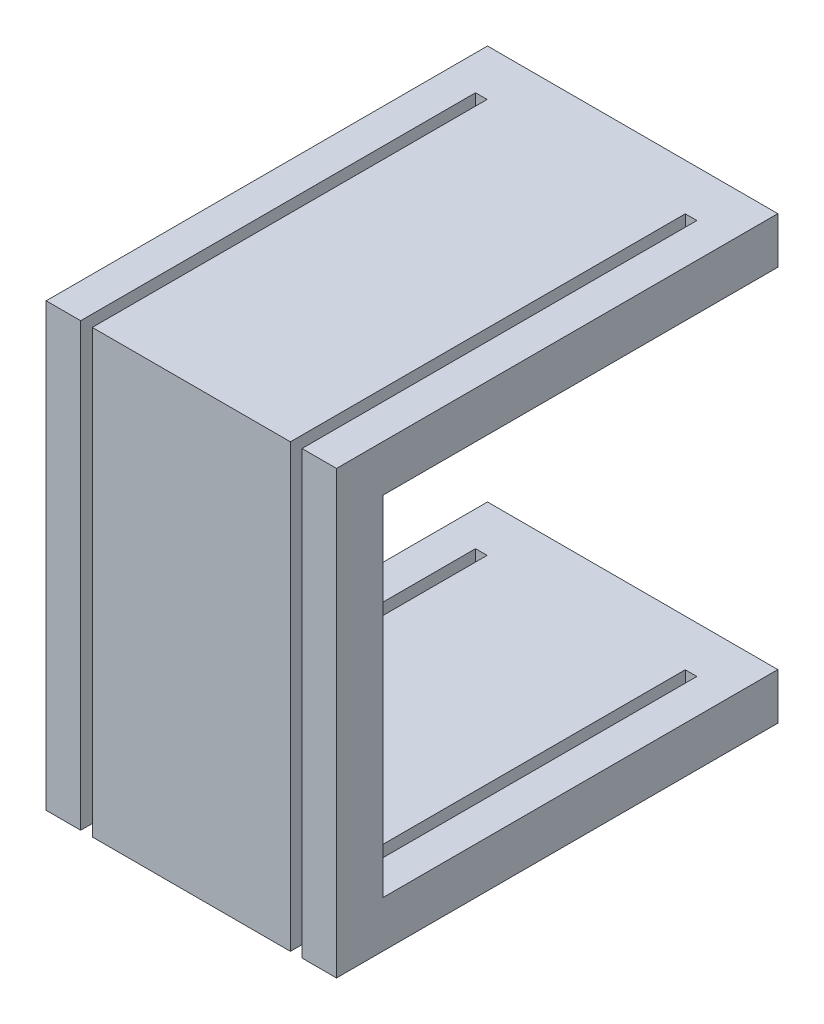
ISO-10303-21;
HEADER;
FILE_DESCRIPTION(('STEP AP214'),'2;1');
FILE_NAME('part.step','',(''),(''),'','','');
FILE_SCHEMA(('AUTOMOTIVE_DESIGN { 1 0 10303 214 1 1 1 1 }'));
ENDSEC;
DATA;
#1=APPLICATION_CONTEXT('core data for automotive mechanical design processes');
#2=APPLICATION_PROTOCOL_DEFINITION('international standard','automotive_design',2000,#1);
#3=PRODUCT_CONTEXT('',#1,'mechanical');
#4=PRODUCT('Part','Part','',(#3));
#5=PRODUCT_RELATED_PRODUCT_CATEGORY('part','',(#4));
#6=PRODUCT_DEFINITION_FORMATION('','',#4);
#7=PRODUCT_DEFINITION_CONTEXT('part definition',#1,'design');
#8=PRODUCT_DEFINITION('design','',#6,#7);
#9=PRODUCT_DEFINITION_SHAPE('','',#8);
#10=(LENGTH_UNIT() NAMED_UNIT(*) SI_UNIT(.MILLI.,.METRE.));
#11=(NAMED_UNIT(*) PLANE_ANGLE_UNIT() SI_UNIT($,.RADIAN.));
#12=(NAMED_UNIT(*) SI_UNIT($,.STERADIAN.) SOLID_ANGLE_UNIT());
#13=UNCERTAINTY_MEASURE_WITH_UNIT(LENGTH_MEASURE(1.E-05),#10,'distance_accuracy_value','');
#14=(GEOMETRIC_REPRESENTATION_CONTEXT(3) GLOBAL_UNCERTAINTY_ASSIGNED_CONTEXT((#13)) GLOBAL_UNIT_ASSIGNED_CONTEXT((#10,
#11,#12)) REPRESENTATION_CONTEXT('',''));
#15=CARTESIAN_POINT('',(0.,0.,0.));
#16=DIRECTION('',(0.,0.,1.));
#17=DIRECTION('',(1.,0.,0.));
#18=AXIS2_PLACEMENT_3D('',#15,#16,#17);
#19=CARTESIAN_POINT('',(25.,0.,-2.));
#20=DIRECTION('',(0.,0.,-1.));
#21=DIRECTION('',(0.,1.,0.));
#22=AXIS2_PLACEMENT_3D('',#19,#20,#21);
#23=PLANE('',#22);
#24=DIRECTION('',(0.,1.,0.));
#25=VECTOR('',#24,1.);
#26=CARTESIAN_POINT('',(2.96994501843689,0.,-2.));
#27=LINE('',#26,#25);
#28=CARTESIAN_POINT('',(2.96994501843689,-15.,-2.));
#29=VERTEX_POINT('',#28);
#30=CARTESIAN_POINT('',(2.96994501843689,15.,-2.));
#31=VERTEX_POINT('',#30);
#32=EDGE_CURVE('E275',#29,#31,#27,.T.);
#33=ORIENTED_EDGE('',*,*,#32,.F.);
#34=DIRECTION('',(-1.,0.,0.));
#35=VECTOR('',#34,1.);
#36=CARTESIAN_POINT('',(25.,-15.,-2.));
#37=LINE('',#36,#35);
#38=CARTESIAN_POINT('',(0.,-15.,-2.));
#39=VERTEX_POINT('',#38);
#40=EDGE_CURVE('E302',#29,#39,#37,.T.);
#41=ORIENTED_EDGE('',*,*,#40,.T.);
#42=DIRECTION('',(0.,-1.,0.));
#43=VECTOR('',#42,1.);
#44=CARTESIAN_POINT('',(0.,0.,-2.));
#45=LINE('',#44,#43);
#46=CARTESIAN_POINT('',(0.,15.,-2.));
#47=VERTEX_POINT('',#46);
#48=EDGE_CURVE('E280',#47,#39,#45,.T.);
#49=ORIENTED_EDGE('',*,*,#48,.F.);
#50=DIRECTION('',(-1.,0.,0.));
#51=VECTOR('',#50,1.);
#52=CARTESIAN_POINT('',(25.,15.,-2.));
#53=LINE('',#52,#51);
#54=EDGE_CURVE('E346',#31,#47,#53,.T.);
#55=ORIENTED_EDGE('',*,*,#54,.F.);
#56=EDGE_LOOP('',(#33,#41,#49,#55));
#57=FACE_BOUND('',#56,.T.);
#58=ADVANCED_FACE('F39',(#57),#23,.T.);
#59=DIRECTION('',(0.,-1.,0.));
#60=VECTOR('',#59,1.);
#61=CARTESIAN_POINT('',(22.0300549815631,0.,-2.));
#62=LINE('',#61,#60);
#63=CARTESIAN_POINT('',(22.0300549815631,15.,-2.));
#64=VERTEX_POINT('',#63);
#65=CARTESIAN_POINT('',(22.0300549815631,-15.,-2.));
#66=VERTEX_POINT('',#65);
#67=EDGE_CURVE('E263',#64,#66,#62,.T.);
#68=ORIENTED_EDGE('',*,*,#67,.F.);
#69=CARTESIAN_POINT('',(25.,15.,-2.));
#70=VERTEX_POINT('',#69);
#71=EDGE_CURVE('E347',#70,#64,#53,.T.);
#72=ORIENTED_EDGE('',*,*,#71,.F.);
#73=DIRECTION('',(0.,-1.,0.));
#74=VECTOR('',#73,1.);
#75=CARTESIAN_POINT('',(25.,0.,-2.));
#76=LINE('',#75,#74);
#77=CARTESIAN_POINT('',(25.,-15.,-2.));
#78=VERTEX_POINT('',#77);
#79=EDGE_CURVE('E281',#70,#78,#76,.T.);
#80=ORIENTED_EDGE('',*,*,#79,.T.);
#81=EDGE_CURVE('E324',#78,#66,#37,.T.);
#82=ORIENTED_EDGE('',*,*,#81,.T.);
#83=EDGE_LOOP('',(#68,#72,#80,#82));
#84=FACE_BOUND('',#83,.T.);
#85=ADVANCED_FACE('F438',(#84),#23,.T.);
#86=CARTESIAN_POINT('',(25.,0.,2.));
#87=DIRECTION('',(0.,0.,-1.));
#88=DIRECTION('',(0.,1.,0.));
#89=AXIS2_PLACEMENT_3D('',#86,#87,#88);
#90=PLANE('',#89);
#91=DIRECTION('',(-1.,0.,0.));
#92=VECTOR('',#91,1.);
#93=CARTESIAN_POINT('',(25.,-19.,2.));
#94=LINE('',#93,#92);
#95=CARTESIAN_POINT('',(2.96994501843689,-19.,2.));
#96=VERTEX_POINT('',#95);
#97=CARTESIAN_POINT('',(0.,-19.,2.));
#98=VERTEX_POINT('',#97);
#99=EDGE_CURVE('E332',#96,#98,#94,.T.);
#100=ORIENTED_EDGE('',*,*,#99,.F.);
#101=DIRECTION('',(0.,-1.,0.));
#102=VECTOR('',#101,1.);
#103=CARTESIAN_POINT('',(2.96994501843689,19.,2.));
#104=LINE('',#103,#102);
#105=CARTESIAN_POINT('',(2.96994501843689,19.,2.));
#106=VERTEX_POINT('',#105);
#107=EDGE_CURVE('E245',#106,#96,#104,.T.);
#108=ORIENTED_EDGE('',*,*,#107,.F.);
#109=DIRECTION('',(-1.,0.,0.));
#110=VECTOR('',#109,1.);
#111=CARTESIAN_POINT('',(25.,19.,2.));
#112=LINE('',#111,#110);
#113=CARTESIAN_POINT('',(0.,19.,2.));
#114=VERTEX_POINT('',#113);
#115=EDGE_CURVE('E336',#106,#114,#112,.T.);
#116=ORIENTED_EDGE('',*,*,#115,.T.);
#117=DIRECTION('',(0.,-1.,0.));
#118=VECTOR('',#117,1.);
#119=CARTESIAN_POINT('',(0.,0.,2.));
#120=LINE('',#119,#118);
#121=EDGE_CURVE('E313',#114,#98,#120,.T.);
#122=ORIENTED_EDGE('',*,*,#121,.T.);
#123=EDGE_LOOP('',(#100,#108,#116,#122));
#124=FACE_BOUND('',#123,.T.);
#125=ADVANCED_FACE('F382',(#124),#90,.F.);
#126=CARTESIAN_POINT('',(25.,19.,2.));
#127=VERTEX_POINT('',#126);
#128=CARTESIAN_POINT('',(22.0300549815631,19.,2.));
#129=VERTEX_POINT('',#128);
#130=EDGE_CURVE('E337',#127,#129,#112,.T.);
#131=ORIENTED_EDGE('',*,*,#130,.T.);
#132=DIRECTION('',(0.,1.,0.));
#133=VECTOR('',#132,1.);
#134=CARTESIAN_POINT('',(22.0300549815631,19.,2.));
#135=LINE('',#134,#133);
#136=CARTESIAN_POINT('',(22.0300549815631,-19.,2.));
#137=VERTEX_POINT('',#136);
#138=EDGE_CURVE('E240',#137,#129,#135,.T.);
#139=ORIENTED_EDGE('',*,*,#138,.F.);
#140=CARTESIAN_POINT('',(25.,-19.,2.));
#141=VERTEX_POINT('',#140);
#142=EDGE_CURVE('E333',#141,#137,#94,.T.);
#143=ORIENTED_EDGE('',*,*,#142,.F.);
#144=DIRECTION('',(0.,-1.,0.));
#145=VECTOR('',#144,1.);
#146=CARTESIAN_POINT('',(25.,0.,2.));
#147=LINE('',#146,#145);
#148=EDGE_CURVE('E292',#127,#141,#147,.T.);
#149=ORIENTED_EDGE('',*,*,#148,.F.);
#150=EDGE_LOOP('',(#131,#139,#143,#149));
#151=FACE_BOUND('',#150,.T.);
#152=ADVANCED_FACE('F429',(#151),#90,.F.);
#153=DIRECTION('',(0.,-1.,0.));
#154=VECTOR('',#153,1.);
#155=CARTESIAN_POINT('',(3.96994501843688,0.,-2.));
#156=LINE('',#155,#154);
#157=CARTESIAN_POINT('',(3.96994501843688,15.,-2.));
#158=VERTEX_POINT('',#157);
#159=CARTESIAN_POINT('',(3.96994501843688,-15.,-2.));
#160=VERTEX_POINT('',#159);
#161=EDGE_CURVE('E270',#158,#160,#156,.T.);
#162=ORIENTED_EDGE('',*,*,#161,.F.);
#163=CARTESIAN_POINT('',(21.0300549815631,15.,-2.));
#164=VERTEX_POINT('',#163);
#165=EDGE_CURVE('E351',#164,#158,#53,.T.);
#166=ORIENTED_EDGE('',*,*,#165,.F.);
#167=DIRECTION('',(0.,1.,0.));
#168=VECTOR('',#167,1.);
#169=CARTESIAN_POINT('',(21.0300549815631,0.,-2.));
#170=LINE('',#169,#168);
#171=CARTESIAN_POINT('',(21.0300549815631,-15.,-2.));
#172=VERTEX_POINT('',#171);
#173=EDGE_CURVE('E258',#172,#164,#170,.T.);
#174=ORIENTED_EDGE('',*,*,#173,.F.);
#175=EDGE_CURVE('E328',#172,#160,#37,.T.);
#176=ORIENTED_EDGE('',*,*,#175,.T.);
#177=EDGE_LOOP('',(#162,#166,#174,#176));
#178=FACE_BOUND('',#177,.T.);
#179=ADVANCED_FACE('F41',(#178),#23,.T.);
#180=CARTESIAN_POINT('',(25.,15.,0.));
#181=DIRECTION('',(0.,1.,0.));
#182=DIRECTION('',(0.,0.,1.));
#183=AXIS2_PLACEMENT_3D('',#180,#181,#182);
#184=PLANE('',#183);
#185=DIRECTION('',(1.,0.,0.));
#186=VECTOR('',#185,1.);
#187=CARTESIAN_POINT('',(25.,15.,-32.));
#188=LINE('',#187,#186);
#189=CARTESIAN_POINT('',(2.96994501843689,15.,-32.));
#190=VERTEX_POINT('',#189);
#191=CARTESIAN_POINT('',(3.96994501843688,15.,-32.));
#192=VERTEX_POINT('',#191);
#193=EDGE_CURVE('E268',#190,#192,#188,.T.);
#194=ORIENTED_EDGE('',*,*,#193,.F.);
#195=DIRECTION('',(0.,0.,1.));
#196=VECTOR('',#195,1.);
#197=CARTESIAN_POINT('',(2.96994501843689,15.,0.));
#198=LINE('',#197,#196);
#199=EDGE_CURVE('E277',#190,#31,#198,.T.);
#200=ORIENTED_EDGE('',*,*,#199,.T.);
#201=ORIENTED_EDGE('',*,*,#54,.T.);
#202=DIRECTION('',(0.,0.,-1.));
#203=VECTOR('',#202,1.);
#204=CARTESIAN_POINT('',(0.,15.,0.));
#205=LINE('',#204,#203);
#206=CARTESIAN_POINT('',(0.,15.,-36.));
#207=VERTEX_POINT('',#206);
#208=EDGE_CURVE('E305',#47,#207,#205,.T.);
#209=ORIENTED_EDGE('',*,*,#208,.T.);
#210=DIRECTION('',(-1.,0.,0.));
#211=VECTOR('',#210,1.);
#212=CARTESIAN_POINT('',(25.,15.,-36.));
#213=LINE('',#212,#211);
#214=CARTESIAN_POINT('',(25.,15.,-36.));
#215=VERTEX_POINT('',#214);
#216=EDGE_CURVE('E343',#215,#207,#213,.T.);
#217=ORIENTED_EDGE('',*,*,#216,.F.);
#218=DIRECTION('',(0.,0.,-1.));
#219=VECTOR('',#218,1.);
#220=CARTESIAN_POINT('',(25.,15.,0.));
#221=LINE('',#220,#219);
#222=EDGE_CURVE('E284',#70,#215,#221,.T.);
#223=ORIENTED_EDGE('',*,*,#222,.F.);
#224=ORIENTED_EDGE('',*,*,#71,.T.);
#225=DIRECTION('',(0.,0.,-1.));
#226=VECTOR('',#225,1.);
#227=CARTESIAN_POINT('',(22.0300549815631,15.,0.));
#228=LINE('',#227,#226);
#229=CARTESIAN_POINT('',(22.0300549815631,15.,-32.));
#230=VERTEX_POINT('',#229);
#231=EDGE_CURVE('E265',#64,#230,#228,.T.);
#232=ORIENTED_EDGE('',*,*,#231,.T.);
#233=DIRECTION('',(1.,0.,0.));
#234=VECTOR('',#233,1.);
#235=CARTESIAN_POINT('',(25.,15.,-32.));
#236=LINE('',#235,#234);
#237=CARTESIAN_POINT('',(21.0300549815631,15.,-32.));
#238=VERTEX_POINT('',#237);
#239=EDGE_CURVE('E256',#238,#230,#236,.T.);
#240=ORIENTED_EDGE('',*,*,#239,.F.);
#241=DIRECTION('',(0.,0.,1.));
#242=VECTOR('',#241,1.);
#243=CARTESIAN_POINT('',(21.0300549815631,15.,0.));
#244=LINE('',#243,#242);
#245=EDGE_CURVE('E260',#238,#164,#244,.T.);
#246=ORIENTED_EDGE('',*,*,#245,.T.);
#247=ORIENTED_EDGE('',*,*,#165,.T.);
#248=DIRECTION('',(0.,0.,-1.));
#249=VECTOR('',#248,1.);
#250=CARTESIAN_POINT('',(3.96994501843688,15.,0.));
#251=LINE('',#250,#249);
#252=EDGE_CURVE('E272',#158,#192,#251,.T.);
#253=ORIENTED_EDGE('',*,*,#252,.T.);
#254=EDGE_LOOP('',(#194,#200,#201,#209,#217,#223,#224,#232,#240,#246,#247,#253));
#255=FACE_BOUND('',#254,.T.);
#256=ADVANCED_FACE('F400',(#255),#184,.F.);
#257=CARTESIAN_POINT('',(25.,0.,-36.));
#258=DIRECTION('',(0.,0.,1.));
#259=DIRECTION('',(1.,0.,0.));
#260=AXIS2_PLACEMENT_3D('',#257,#258,#259);
#261=PLANE('',#260);
#262=DIRECTION('',(0.,1.,0.));
#263=VECTOR('',#262,1.);
#264=CARTESIAN_POINT('',(0.,0.,-36.));
#265=LINE('',#264,#263);
#266=CARTESIAN_POINT('',(0.,19.,-36.));
#267=VERTEX_POINT('',#266);
#268=EDGE_CURVE('E307',#207,#267,#265,.T.);
#269=ORIENTED_EDGE('',*,*,#268,.T.);
#270=DIRECTION('',(-1.,0.,0.));
#271=VECTOR('',#270,1.);
#272=CARTESIAN_POINT('',(25.,19.,-36.));
#273=LINE('',#272,#271);
#274=CARTESIAN_POINT('',(25.,19.,-36.));
#275=VERTEX_POINT('',#274);
#276=EDGE_CURVE('E340',#275,#267,#273,.T.);
#277=ORIENTED_EDGE('',*,*,#276,.F.);
#278=DIRECTION('',(0.,1.,0.));
#279=VECTOR('',#278,1.);
#280=CARTESIAN_POINT('',(25.,0.,-36.));
#281=LINE('',#280,#279);
#282=EDGE_CURVE('E287',#215,#275,#281,.T.);
#283=ORIENTED_EDGE('',*,*,#282,.F.);
#284=ORIENTED_EDGE('',*,*,#216,.T.);
#285=EDGE_LOOP('',(#269,#277,#283,#284));
#286=FACE_BOUND('',#285,.T.);
#287=ADVANCED_FACE('F465',(#286),#261,.F.);
#288=CARTESIAN_POINT('',(25.,19.,0.));
#289=DIRECTION('',(0.,1.,0.));
#290=DIRECTION('',(0.,0.,1.));
#291=AXIS2_PLACEMENT_3D('',#288,#289,#290);
#292=PLANE('',#291);
#293=DIRECTION('',(0.,0.,1.));
#294=VECTOR('',#293,1.);
#295=CARTESIAN_POINT('',(2.96994501843689,19.,-32.));
#296=LINE('',#295,#294);
#297=CARTESIAN_POINT('',(2.96994501843689,19.,-32.));
#298=VERTEX_POINT('',#297);
#299=EDGE_CURVE('E226',#298,#106,#296,.T.);
#300=ORIENTED_EDGE('',*,*,#299,.F.);
#301=DIRECTION('',(-1.,0.,0.));
#302=VECTOR('',#301,1.);
#303=CARTESIAN_POINT('',(2.96994501843689,19.,-32.));
#304=LINE('',#303,#302);
#305=CARTESIAN_POINT('',(3.96994501843688,19.,-32.));
#306=VERTEX_POINT('',#305);
#307=EDGE_CURVE('E209',#306,#298,#304,.T.);
#308=ORIENTED_EDGE('',*,*,#307,.F.);
#309=DIRECTION('',(0.,0.,1.));
#310=VECTOR('',#309,1.);
#311=CARTESIAN_POINT('',(3.96994501843688,19.,-32.));
#312=LINE('',#311,#310);
#313=CARTESIAN_POINT('',(3.96994501843688,19.,2.));
#314=VERTEX_POINT('',#313);
#315=EDGE_CURVE('E223',#306,#314,#312,.T.);
#316=ORIENTED_EDGE('',*,*,#315,.T.);
#317=CARTESIAN_POINT('',(21.0300549815631,19.,2.));
#318=VERTEX_POINT('',#317);
#319=EDGE_CURVE('E341',#318,#314,#112,.T.);
#320=ORIENTED_EDGE('',*,*,#319,.F.);
#321=DIRECTION('',(0.,0.,1.));
#322=VECTOR('',#321,1.);
#323=CARTESIAN_POINT('',(21.0300549815631,19.,-32.));
#324=LINE('',#323,#322);
#325=CARTESIAN_POINT('',(21.0300549815631,19.,-32.));
#326=VERTEX_POINT('',#325);
#327=EDGE_CURVE('E231',#326,#318,#324,.T.);
#328=ORIENTED_EDGE('',*,*,#327,.F.);
#329=DIRECTION('',(-1.,0.,0.));
#330=VECTOR('',#329,1.);
#331=CARTESIAN_POINT('',(22.0300549815631,19.,-32.));
#332=LINE('',#331,#330);
#333=CARTESIAN_POINT('',(22.0300549815631,19.,-32.));
#334=VERTEX_POINT('',#333);
#335=EDGE_CURVE('E243',#334,#326,#332,.T.);
#336=ORIENTED_EDGE('',*,*,#335,.F.);
#337=DIRECTION('',(0.,0.,1.));
#338=VECTOR('',#337,1.);
#339=CARTESIAN_POINT('',(22.0300549815631,19.,-32.));
#340=LINE('',#339,#338);
#341=EDGE_CURVE('E237',#334,#129,#340,.T.);
#342=ORIENTED_EDGE('',*,*,#341,.T.);
#343=ORIENTED_EDGE('',*,*,#130,.F.);
#344=DIRECTION('',(0.,0.,-1.));
#345=VECTOR('',#344,1.);
#346=CARTESIAN_POINT('',(25.,19.,0.));
#347=LINE('',#346,#345);
#348=EDGE_CURVE('E289',#127,#275,#347,.T.);
#349=ORIENTED_EDGE('',*,*,#348,.T.);
#350=ORIENTED_EDGE('',*,*,#276,.T.);
#351=DIRECTION('',(0.,0.,-1.));
#352=VECTOR('',#351,1.);
#353=CARTESIAN_POINT('',(0.,19.,0.));
#354=LINE('',#353,#352);
#355=EDGE_CURVE('E310',#114,#267,#354,.T.);
#356=ORIENTED_EDGE('',*,*,#355,.F.);
#357=ORIENTED_EDGE('',*,*,#115,.F.);
#358=EDGE_LOOP('',(#300,#308,#316,#320,#328,#336,#342,#343,#349,#350,#356,#357));
#359=FACE_BOUND('',#358,.T.);
#360=ADVANCED_FACE('F385',(#359),#292,.T.);
#361=ORIENTED_EDGE('',*,*,#319,.T.);
#362=DIRECTION('',(0.,1.,0.));
#363=VECTOR('',#362,1.);
#364=CARTESIAN_POINT('',(3.96994501843688,19.,2.));
#365=LINE('',#364,#363);
#366=CARTESIAN_POINT('',(3.96994501843689,-19.,2.));
#367=VERTEX_POINT('',#366);
#368=EDGE_CURVE('E368',#367,#314,#365,.T.);
#369=ORIENTED_EDGE('',*,*,#368,.F.);
#370=CARTESIAN_POINT('',(21.0300549815631,-19.,2.));
#371=VERTEX_POINT('',#370);
#372=EDGE_CURVE('E222',#371,#367,#94,.T.);
#373=ORIENTED_EDGE('',*,*,#372,.F.);
#374=DIRECTION('',(0.,-1.,0.));
#375=VECTOR('',#374,1.);
#376=CARTESIAN_POINT('',(21.0300549815631,19.,2.));
#377=LINE('',#376,#375);
#378=EDGE_CURVE('E242',#318,#371,#377,.T.);
#379=ORIENTED_EDGE('',*,*,#378,.F.);
#380=EDGE_LOOP('',(#361,#369,#373,#379));
#381=FACE_BOUND('',#380,.T.);
#382=ADVANCED_FACE('F390',(#381),#90,.F.);
#383=CARTESIAN_POINT('',(25.,-19.,0.));
#384=DIRECTION('',(0.,1.,0.));
#385=DIRECTION('',(0.,0.,1.));
#386=AXIS2_PLACEMENT_3D('',#383,#384,#385);
#387=PLANE('',#386);
#388=DIRECTION('',(1.,0.,0.));
#389=VECTOR('',#388,1.);
#390=CARTESIAN_POINT('',(2.96994501843689,-19.,-32.));
#391=LINE('',#390,#389);
#392=CARTESIAN_POINT('',(2.96994501843689,-19.,-32.));
#393=VERTEX_POINT('',#392);
#394=CARTESIAN_POINT('',(3.96994501843689,-19.,-32.));
#395=VERTEX_POINT('',#394);
#396=EDGE_CURVE('E213',#393,#395,#391,.T.);
#397=ORIENTED_EDGE('',*,*,#396,.F.);
#398=DIRECTION('',(0.,0.,1.));
#399=VECTOR('',#398,1.);
#400=CARTESIAN_POINT('',(2.96994501843689,-19.,-32.));
#401=LINE('',#400,#399);
#402=EDGE_CURVE('E54',#393,#96,#401,.T.);
#403=ORIENTED_EDGE('',*,*,#402,.T.);
#404=ORIENTED_EDGE('',*,*,#99,.T.);
#405=DIRECTION('',(0.,0.,-1.));
#406=VECTOR('',#405,1.);
#407=CARTESIAN_POINT('',(0.,-19.,0.));
#408=LINE('',#407,#406);
#409=CARTESIAN_POINT('',(0.,-19.,-36.));
#410=VERTEX_POINT('',#409);
#411=EDGE_CURVE('E316',#98,#410,#408,.T.);
#412=ORIENTED_EDGE('',*,*,#411,.T.);
#413=DIRECTION('',(-1.,0.,0.));
#414=VECTOR('',#413,1.);
#415=CARTESIAN_POINT('',(25.,-19.,-36.));
#416=LINE('',#415,#414);
#417=CARTESIAN_POINT('',(25.,-19.,-36.));
#418=VERTEX_POINT('',#417);
#419=EDGE_CURVE('E330',#418,#410,#416,.T.);
#420=ORIENTED_EDGE('',*,*,#419,.F.);
#421=DIRECTION('',(0.,0.,-1.));
#422=VECTOR('',#421,1.);
#423=CARTESIAN_POINT('',(25.,-19.,0.));
#424=LINE('',#423,#422);
#425=EDGE_CURVE('E294',#141,#418,#424,.T.);
#426=ORIENTED_EDGE('',*,*,#425,.F.);
#427=ORIENTED_EDGE('',*,*,#142,.T.);
#428=DIRECTION('',(0.,0.,1.));
#429=VECTOR('',#428,1.);
#430=CARTESIAN_POINT('',(22.0300549815631,-19.,-32.));
#431=LINE('',#430,#429);
#432=CARTESIAN_POINT('',(22.0300549815631,-19.,-32.));
#433=VERTEX_POINT('',#432);
#434=EDGE_CURVE('E235',#433,#137,#431,.T.);
#435=ORIENTED_EDGE('',*,*,#434,.F.);
#436=DIRECTION('',(1.,0.,0.));
#437=VECTOR('',#436,1.);
#438=CARTESIAN_POINT('',(22.0300549815631,-19.,-32.));
#439=LINE('',#438,#437);
#440=CARTESIAN_POINT('',(21.0300549815631,-19.,-32.));
#441=VERTEX_POINT('',#440);
#442=EDGE_CURVE('E248',#441,#433,#439,.T.);
#443=ORIENTED_EDGE('',*,*,#442,.F.);
#444=DIRECTION('',(0.,0.,1.));
#445=VECTOR('',#444,1.);
#446=CARTESIAN_POINT('',(21.0300549815631,-19.,-32.));
#447=LINE('',#446,#445);
#448=EDGE_CURVE('E62',#441,#371,#447,.T.);
#449=ORIENTED_EDGE('',*,*,#448,.T.);
#450=ORIENTED_EDGE('',*,*,#372,.T.);
#451=DIRECTION('',(0.,0.,1.));
#452=VECTOR('',#451,1.);
#453=CARTESIAN_POINT('',(3.96994501843689,-19.,-32.));
#454=LINE('',#453,#452);
#455=EDGE_CURVE('E204',#395,#367,#454,.T.);
#456=ORIENTED_EDGE('',*,*,#455,.F.);
#457=EDGE_LOOP('',(#397,#403,#404,#412,#420,#426,#427,#435,#443,#449,#450,#456));
#458=FACE_BOUND('',#457,.T.);
#459=ADVANCED_FACE('F220',(#458),#387,.F.);
#460=CARTESIAN_POINT('',(25.,0.,-36.));
#461=DIRECTION('',(0.,0.,-1.));
#462=DIRECTION('',(0.,1.,0.));
#463=AXIS2_PLACEMENT_3D('',#460,#461,#462);
#464=PLANE('',#463);
#465=DIRECTION('',(0.,-1.,0.));
#466=VECTOR('',#465,1.);
#467=CARTESIAN_POINT('',(0.,0.,-36.));
#468=LINE('',#467,#466);
#469=CARTESIAN_POINT('',(0.,-15.,-36.));
#470=VERTEX_POINT('',#469);
#471=EDGE_CURVE('E319',#470,#410,#468,.T.);
#472=ORIENTED_EDGE('',*,*,#471,.F.);
#473=DIRECTION('',(-1.,0.,0.));
#474=VECTOR('',#473,1.);
#475=CARTESIAN_POINT('',(25.,-15.,-36.));
#476=LINE('',#475,#474);
#477=CARTESIAN_POINT('',(25.,-15.,-36.));
#478=VERTEX_POINT('',#477);
#479=EDGE_CURVE('E327',#478,#470,#476,.T.);
#480=ORIENTED_EDGE('',*,*,#479,.F.);
#481=DIRECTION('',(0.,-1.,0.));
#482=VECTOR('',#481,1.);
#483=CARTESIAN_POINT('',(25.,0.,-36.));
#484=LINE('',#483,#482);
#485=EDGE_CURVE('E296',#478,#418,#484,.T.);
#486=ORIENTED_EDGE('',*,*,#485,.T.);
#487=ORIENTED_EDGE('',*,*,#419,.T.);
#488=EDGE_LOOP('',(#472,#480,#486,#487));
#489=FACE_BOUND('',#488,.T.);
#490=ADVANCED_FACE('F446',(#489),#464,.T.);
#491=CARTESIAN_POINT('',(25.,-15.,0.));
#492=DIRECTION('',(0.,1.,0.));
#493=DIRECTION('',(0.,0.,1.));
#494=AXIS2_PLACEMENT_3D('',#491,#492,#493);
#495=PLANE('',#494);
#496=DIRECTION('',(0.,0.,1.));
#497=VECTOR('',#496,1.);
#498=CARTESIAN_POINT('',(2.96994501843689,-15.,0.));
#499=LINE('',#498,#497);
#500=CARTESIAN_POINT('',(2.96994501843689,-15.,-32.));
#501=VERTEX_POINT('',#500);
#502=EDGE_CURVE('E11',#501,#29,#499,.T.);
#503=ORIENTED_EDGE('',*,*,#502,.F.);
#504=DIRECTION('',(1.,0.,0.));
#505=VECTOR('',#504,1.);
#506=CARTESIAN_POINT('',(25.,-15.,-32.));
#507=LINE('',#506,#505);
#508=CARTESIAN_POINT('',(3.96994501843688,-15.,-32.));
#509=VERTEX_POINT('',#508);
#510=EDGE_CURVE('E359',#501,#509,#507,.T.);
#511=ORIENTED_EDGE('',*,*,#510,.T.);
#512=DIRECTION('',(0.,0.,-1.));
#513=VECTOR('',#512,1.);
#514=CARTESIAN_POINT('',(3.96994501843688,-15.,0.));
#515=LINE('',#514,#513);
#516=EDGE_CURVE('E47',#160,#509,#515,.T.);
#517=ORIENTED_EDGE('',*,*,#516,.F.);
#518=ORIENTED_EDGE('',*,*,#175,.F.);
#519=DIRECTION('',(0.,0.,1.));
#520=VECTOR('',#519,1.);
#521=CARTESIAN_POINT('',(21.0300549815631,-15.,0.));
#522=LINE('',#521,#520);
#523=CARTESIAN_POINT('',(21.0300549815631,-15.,-32.));
#524=VERTEX_POINT('',#523);
#525=EDGE_CURVE('E354',#524,#172,#522,.T.);
#526=ORIENTED_EDGE('',*,*,#525,.F.);
#527=DIRECTION('',(1.,0.,0.));
#528=VECTOR('',#527,1.);
#529=CARTESIAN_POINT('',(25.,-15.,-32.));
#530=LINE('',#529,#528);
#531=CARTESIAN_POINT('',(22.0300549815631,-15.,-32.));
#532=VERTEX_POINT('',#531);
#533=EDGE_CURVE('E350',#524,#532,#530,.T.);
#534=ORIENTED_EDGE('',*,*,#533,.T.);
#535=DIRECTION('',(0.,0.,-1.));
#536=VECTOR('',#535,1.);
#537=CARTESIAN_POINT('',(22.0300549815631,-15.,0.));
#538=LINE('',#537,#536);
#539=EDGE_CURVE('E356',#66,#532,#538,.T.);
#540=ORIENTED_EDGE('',*,*,#539,.F.);
#541=ORIENTED_EDGE('',*,*,#81,.F.);
#542=DIRECTION('',(0.,0.,-1.));
#543=VECTOR('',#542,1.);
#544=CARTESIAN_POINT('',(25.,-15.,0.));
#545=LINE('',#544,#543);
#546=EDGE_CURVE('E299',#78,#478,#545,.T.);
#547=ORIENTED_EDGE('',*,*,#546,.T.);
#548=ORIENTED_EDGE('',*,*,#479,.T.);
#549=DIRECTION('',(0.,0.,-1.));
#550=VECTOR('',#549,1.);
#551=CARTESIAN_POINT('',(0.,-15.,0.));
#552=LINE('',#551,#550);
#553=EDGE_CURVE('E285',#39,#470,#552,.T.);
#554=ORIENTED_EDGE('',*,*,#553,.F.);
#555=ORIENTED_EDGE('',*,*,#40,.F.);
#556=EDGE_LOOP('',(#503,#511,#517,#518,#526,#534,#540,#541,#547,#548,#554,#555));
#557=FACE_BOUND('',#556,.T.);
#558=ADVANCED_FACE('F362',(#557),#495,.T.);
#559=CARTESIAN_POINT('',(25.,0.,0.));
#560=DIRECTION('',(1.,0.,0.));
#561=DIRECTION('',(0.,0.,-1.));
#562=AXIS2_PLACEMENT_3D('',#559,#560,#561);
#563=PLANE('',#562);
#564=ORIENTED_EDGE('',*,*,#79,.F.);
#565=ORIENTED_EDGE('',*,*,#222,.T.);
#566=ORIENTED_EDGE('',*,*,#282,.T.);
#567=ORIENTED_EDGE('',*,*,#348,.F.);
#568=ORIENTED_EDGE('',*,*,#148,.T.);
#569=ORIENTED_EDGE('',*,*,#425,.T.);
#570=ORIENTED_EDGE('',*,*,#485,.F.);
#571=ORIENTED_EDGE('',*,*,#546,.F.);
#572=EDGE_LOOP('',(#564,#565,#566,#567,#568,#569,#570,#571));
#573=FACE_BOUND('',#572,.T.);
#574=ADVANCED_FACE('F443',(#573),#563,.T.);
#575=CARTESIAN_POINT('',(0.,0.,0.));
#576=DIRECTION('',(1.,0.,0.));
#577=DIRECTION('',(0.,0.,-1.));
#578=AXIS2_PLACEMENT_3D('',#575,#576,#577);
#579=PLANE('',#578);
#580=ORIENTED_EDGE('',*,*,#48,.T.);
#581=ORIENTED_EDGE('',*,*,#553,.T.);
#582=ORIENTED_EDGE('',*,*,#471,.T.);
#583=ORIENTED_EDGE('',*,*,#411,.F.);
#584=ORIENTED_EDGE('',*,*,#121,.F.);
#585=ORIENTED_EDGE('',*,*,#355,.T.);
#586=ORIENTED_EDGE('',*,*,#268,.F.);
#587=ORIENTED_EDGE('',*,*,#208,.F.);
#588=EDGE_LOOP('',(#580,#581,#582,#583,#584,#585,#586,#587));
#589=FACE_BOUND('',#588,.T.);
#590=ADVANCED_FACE('F412',(#589),#579,.F.);
#591=CARTESIAN_POINT('',(22.0300549815631,19.,-32.));
#592=DIRECTION('',(1.,0.,0.));
#593=DIRECTION('',(0.,0.,-1.));
#594=AXIS2_PLACEMENT_3D('',#591,#592,#593);
#595=PLANE('',#594);
#596=ORIENTED_EDGE('',*,*,#67,.T.);
#597=ORIENTED_EDGE('',*,*,#539,.T.);
#598=DIRECTION('',(0.,1.,0.));
#599=VECTOR('',#598,1.);
#600=CARTESIAN_POINT('',(22.0300549815631,19.,-32.));
#601=LINE('',#600,#599);
#602=EDGE_CURVE('E246',#433,#532,#601,.T.);
#603=ORIENTED_EDGE('',*,*,#602,.F.);
#604=ORIENTED_EDGE('',*,*,#434,.T.);
#605=ORIENTED_EDGE('',*,*,#138,.T.);
#606=ORIENTED_EDGE('',*,*,#341,.F.);
#607=EDGE_CURVE('E233',#230,#334,#601,.T.);
#608=ORIENTED_EDGE('',*,*,#607,.F.);
#609=ORIENTED_EDGE('',*,*,#231,.F.);
#610=EDGE_LOOP('',(#596,#597,#603,#604,#605,#606,#608,#609));
#611=FACE_BOUND('',#610,.T.);
#612=ADVANCED_FACE('F426',(#611),#595,.F.);
#613=CARTESIAN_POINT('',(21.0300549815631,19.,-32.));
#614=DIRECTION('',(-1.,0.,0.));
#615=DIRECTION('',(0.,-1.,0.));
#616=AXIS2_PLACEMENT_3D('',#613,#614,#615);
#617=PLANE('',#616);
#618=DIRECTION('',(0.,-1.,0.));
#619=VECTOR('',#618,1.);
#620=CARTESIAN_POINT('',(21.0300549815631,19.,-32.));
#621=LINE('',#620,#619);
#622=EDGE_CURVE('E251',#326,#238,#621,.T.);
#623=ORIENTED_EDGE('',*,*,#622,.F.);
#624=ORIENTED_EDGE('',*,*,#327,.T.);
#625=ORIENTED_EDGE('',*,*,#378,.T.);
#626=ORIENTED_EDGE('',*,*,#448,.F.);
#627=EDGE_CURVE('E250',#524,#441,#621,.T.);
#628=ORIENTED_EDGE('',*,*,#627,.F.);
#629=ORIENTED_EDGE('',*,*,#525,.T.);
#630=ORIENTED_EDGE('',*,*,#173,.T.);
#631=ORIENTED_EDGE('',*,*,#245,.F.);
#632=EDGE_LOOP('',(#623,#624,#625,#626,#628,#629,#630,#631));
#633=FACE_BOUND('',#632,.T.);
#634=ADVANCED_FACE('F416',(#633),#617,.F.);
#635=CARTESIAN_POINT('',(0.,0.,-32.));
#636=DIRECTION('',(0.,0.,1.));
#637=DIRECTION('',(1.,0.,0.));
#638=AXIS2_PLACEMENT_3D('',#635,#636,#637);
#639=PLANE('',#638);
#640=ORIENTED_EDGE('',*,*,#239,.T.);
#641=ORIENTED_EDGE('',*,*,#607,.T.);
#642=ORIENTED_EDGE('',*,*,#335,.T.);
#643=ORIENTED_EDGE('',*,*,#622,.T.);
#644=EDGE_LOOP('',(#640,#641,#642,#643));
#645=FACE_BOUND('',#644,.T.);
#646=ADVANCED_FACE('F539',(#645),#639,.T.);
#647=ORIENTED_EDGE('',*,*,#627,.T.);
#648=ORIENTED_EDGE('',*,*,#442,.T.);
#649=ORIENTED_EDGE('',*,*,#602,.T.);
#650=ORIENTED_EDGE('',*,*,#533,.F.);
#651=EDGE_LOOP('',(#647,#648,#649,#650));
#652=FACE_BOUND('',#651,.T.);
#653=ADVANCED_FACE('F419',(#652),#639,.T.);
#654=CARTESIAN_POINT('',(2.96994501843689,19.,-32.));
#655=DIRECTION('',(-1.,0.,0.));
#656=DIRECTION('',(0.,0.,1.));
#657=AXIS2_PLACEMENT_3D('',#654,#655,#656);
#658=PLANE('',#657);
#659=DIRECTION('',(0.,-1.,0.));
#660=VECTOR('',#659,1.);
#661=CARTESIAN_POINT('',(2.96994501843689,19.,-32.));
#662=LINE('',#661,#660);
#663=EDGE_CURVE('E217',#298,#190,#662,.T.);
#664=ORIENTED_EDGE('',*,*,#663,.F.);
#665=ORIENTED_EDGE('',*,*,#299,.T.);
#666=ORIENTED_EDGE('',*,*,#107,.T.);
#667=ORIENTED_EDGE('',*,*,#402,.F.);
#668=EDGE_CURVE('E215',#501,#393,#662,.T.);
#669=ORIENTED_EDGE('',*,*,#668,.F.);
#670=ORIENTED_EDGE('',*,*,#502,.T.);
#671=ORIENTED_EDGE('',*,*,#32,.T.);
#672=ORIENTED_EDGE('',*,*,#199,.F.);
#673=EDGE_LOOP('',(#664,#665,#666,#667,#669,#670,#671,#672));
#674=FACE_BOUND('',#673,.T.);
#675=ADVANCED_FACE('F366',(#674),#658,.F.);
#676=CARTESIAN_POINT('',(3.96994501843688,19.,-32.));
#677=DIRECTION('',(1.,0.,0.));
#678=DIRECTION('',(0.,1.,0.));
#679=AXIS2_PLACEMENT_3D('',#676,#677,#678);
#680=PLANE('',#679);
#681=ORIENTED_EDGE('',*,*,#161,.T.);
#682=ORIENTED_EDGE('',*,*,#516,.T.);
#683=DIRECTION('',(0.,1.,0.));
#684=VECTOR('',#683,1.);
#685=CARTESIAN_POINT('',(3.96994501843688,19.,-32.));
#686=LINE('',#685,#684);
#687=EDGE_CURVE('E200',#395,#509,#686,.T.);
#688=ORIENTED_EDGE('',*,*,#687,.F.);
#689=ORIENTED_EDGE('',*,*,#455,.T.);
#690=ORIENTED_EDGE('',*,*,#368,.T.);
#691=ORIENTED_EDGE('',*,*,#315,.F.);
#692=EDGE_CURVE('E210',#192,#306,#686,.T.);
#693=ORIENTED_EDGE('',*,*,#692,.F.);
#694=ORIENTED_EDGE('',*,*,#252,.F.);
#695=EDGE_LOOP('',(#681,#682,#688,#689,#690,#691,#693,#694));
#696=FACE_BOUND('',#695,.T.);
#697=ADVANCED_FACE('F202',(#696),#680,.F.);
#698=CARTESIAN_POINT('',(0.,0.,-32.));
#699=DIRECTION('',(0.,0.,1.));
#700=DIRECTION('',(1.,0.,0.));
#701=AXIS2_PLACEMENT_3D('',#698,#699,#700);
#702=PLANE('',#701);
#703=ORIENTED_EDGE('',*,*,#193,.T.);
#704=ORIENTED_EDGE('',*,*,#692,.T.);
#705=ORIENTED_EDGE('',*,*,#307,.T.);
#706=ORIENTED_EDGE('',*,*,#663,.T.);
#707=EDGE_LOOP('',(#703,#704,#705,#706));
#708=FACE_BOUND('',#707,.T.);
#709=ADVANCED_FACE('F575',(#708),#702,.T.);
#710=ORIENTED_EDGE('',*,*,#668,.T.);
#711=ORIENTED_EDGE('',*,*,#396,.T.);
#712=ORIENTED_EDGE('',*,*,#687,.T.);
#713=ORIENTED_EDGE('',*,*,#510,.F.);
#714=EDGE_LOOP('',(#710,#711,#712,#713));
#715=FACE_BOUND('',#714,.T.);
#716=ADVANCED_FACE('F214',(#715),#702,.T.);
#717=CLOSED_SHELL('',(#58,#85,#125,#152,#179,#256,#287,#360,#382,#459,#490,#558,#574,#590,#612,
#634,#646,#653,#675,#697,#709,#716));
#718=MANIFOLD_SOLID_BREP('B2',#717);
#719=ADVANCED_BREP_SHAPE_REPRESENTATION('',(#18,#718),#14);
#720=SHAPE_DEFINITION_REPRESENTATION(#9,#719);
ENDSEC;
END-ISO-10303-21;
